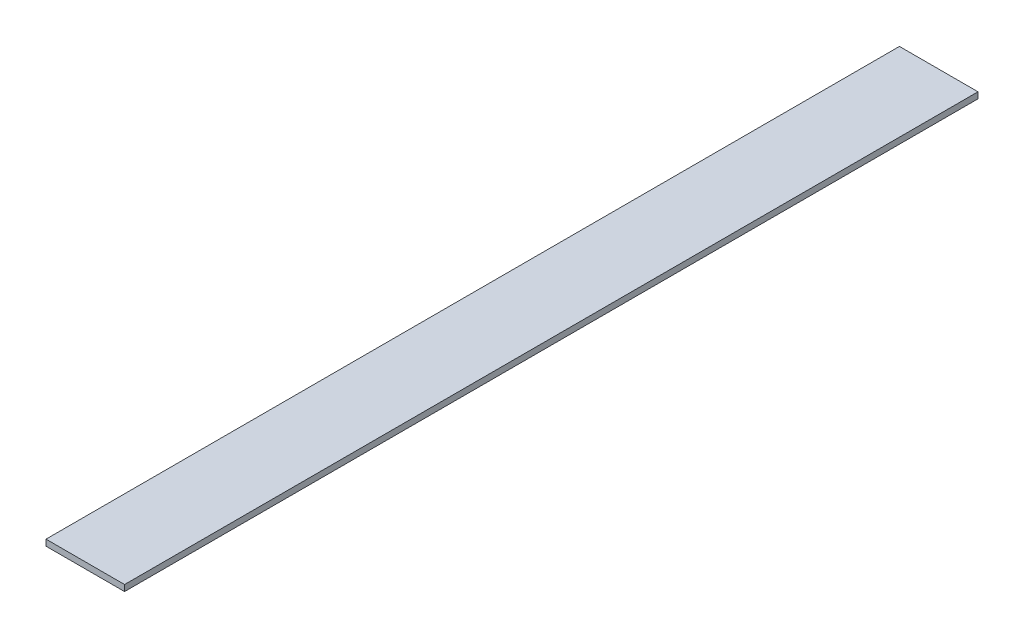
ISO-10303-21;
HEADER;
FILE_DESCRIPTION(('STEP AP214'),'2;1');
FILE_NAME('part.step','',(''),(''),'','','');
FILE_SCHEMA(('AUTOMOTIVE_DESIGN { 1 0 10303 214 1 1 1 1 }'));
ENDSEC;
DATA;
#1=APPLICATION_CONTEXT('core data for automotive mechanical design processes');
#2=APPLICATION_PROTOCOL_DEFINITION('international standard','automotive_design',2000,#1);
#3=PRODUCT_CONTEXT('',#1,'mechanical');
#4=PRODUCT('Part','Part','',(#3));
#5=PRODUCT_RELATED_PRODUCT_CATEGORY('part','',(#4));
#6=PRODUCT_DEFINITION_FORMATION('','',#4);
#7=PRODUCT_DEFINITION_CONTEXT('part definition',#1,'design');
#8=PRODUCT_DEFINITION('design','',#6,#7);
#9=PRODUCT_DEFINITION_SHAPE('','',#8);
#10=(LENGTH_UNIT() NAMED_UNIT(*) SI_UNIT(.MILLI.,.METRE.));
#11=(NAMED_UNIT(*) PLANE_ANGLE_UNIT() SI_UNIT($,.RADIAN.));
#12=(NAMED_UNIT(*) SI_UNIT($,.STERADIAN.) SOLID_ANGLE_UNIT());
#13=UNCERTAINTY_MEASURE_WITH_UNIT(LENGTH_MEASURE(1.E-05),#10,'distance_accuracy_value','');
#14=(GEOMETRIC_REPRESENTATION_CONTEXT(3) GLOBAL_UNCERTAINTY_ASSIGNED_CONTEXT((#13)) GLOBAL_UNIT_ASSIGNED_CONTEXT((#10,
#11,#12)) REPRESENTATION_CONTEXT('',''));
#15=CARTESIAN_POINT('',(0.,0.,0.));
#16=DIRECTION('',(0.,0.,1.));
#17=DIRECTION('',(1.,0.,0.));
#18=AXIS2_PLACEMENT_3D('',#15,#16,#17);
#19=CARTESIAN_POINT('',(0.,0.,441.452));
#20=DIRECTION('',(1.,0.,0.));
#21=DIRECTION('',(0.,0.,-1.));
#22=AXIS2_PLACEMENT_3D('',#19,#20,#21);
#23=PLANE('',#22);
#24=DIRECTION('',(0.,-1.,0.));
#25=VECTOR('',#24,1.);
#26=CARTESIAN_POINT('',(0.,0.,0.));
#27=LINE('',#26,#25);
#28=CARTESIAN_POINT('',(0.,3.175,0.));
#29=VERTEX_POINT('',#28);
#30=CARTESIAN_POINT('',(0.,0.,0.));
#31=VERTEX_POINT('',#30);
#32=EDGE_CURVE('E114',#29,#31,#27,.T.);
#33=ORIENTED_EDGE('',*,*,#32,.T.);
#34=DIRECTION('',(0.,0.,-1.));
#35=VECTOR('',#34,1.);
#36=CARTESIAN_POINT('',(0.,0.,441.452));
#37=LINE('',#36,#35);
#38=CARTESIAN_POINT('',(0.,0.,441.452));
#39=VERTEX_POINT('',#38);
#40=EDGE_CURVE('E11',#39,#31,#37,.T.);
#41=ORIENTED_EDGE('',*,*,#40,.F.);
#42=DIRECTION('',(0.,-1.,0.));
#43=VECTOR('',#42,1.);
#44=CARTESIAN_POINT('',(0.,0.,441.452));
#45=LINE('',#44,#43);
#46=CARTESIAN_POINT('',(0.,3.175,441.452));
#47=VERTEX_POINT('',#46);
#48=EDGE_CURVE('E97',#47,#39,#45,.T.);
#49=ORIENTED_EDGE('',*,*,#48,.F.);
#50=DIRECTION('',(0.,0.,-1.));
#51=VECTOR('',#50,1.);
#52=CARTESIAN_POINT('',(0.,3.175,441.452));
#53=LINE('',#52,#51);
#54=EDGE_CURVE('E110',#47,#29,#53,.T.);
#55=ORIENTED_EDGE('',*,*,#54,.T.);
#56=EDGE_LOOP('',(#33,#41,#49,#55));
#57=FACE_BOUND('',#56,.T.);
#58=ADVANCED_FACE('F45',(#57),#23,.F.);
#59=CARTESIAN_POINT('',(0.,0.,441.452));
#60=DIRECTION('',(0.,1.,0.));
#61=DIRECTION('',(0.,0.,1.));
#62=AXIS2_PLACEMENT_3D('',#59,#60,#61);
#63=PLANE('',#62);
#64=DIRECTION('',(1.,0.,0.));
#65=VECTOR('',#64,1.);
#66=CARTESIAN_POINT('',(0.,0.,0.));
#67=LINE('',#66,#65);
#68=CARTESIAN_POINT('',(40.64,0.,0.));
#69=VERTEX_POINT('',#68);
#70=EDGE_CURVE('E102',#31,#69,#67,.T.);
#71=ORIENTED_EDGE('',*,*,#70,.T.);
#72=DIRECTION('',(0.,0.,-1.));
#73=VECTOR('',#72,1.);
#74=CARTESIAN_POINT('',(40.64,0.,441.452));
#75=LINE('',#74,#73);
#76=CARTESIAN_POINT('',(40.64,0.,441.452));
#77=VERTEX_POINT('',#76);
#78=EDGE_CURVE('E54',#77,#69,#75,.T.);
#79=ORIENTED_EDGE('',*,*,#78,.F.);
#80=DIRECTION('',(1.,0.,0.));
#81=VECTOR('',#80,1.);
#82=CARTESIAN_POINT('',(0.,0.,441.452));
#83=LINE('',#82,#81);
#84=EDGE_CURVE('E92',#39,#77,#83,.T.);
#85=ORIENTED_EDGE('',*,*,#84,.F.);
#86=ORIENTED_EDGE('',*,*,#40,.T.);
#87=EDGE_LOOP('',(#71,#79,#85,#86));
#88=FACE_BOUND('',#87,.T.);
#89=ADVANCED_FACE('F101',(#88),#63,.F.);
#90=CARTESIAN_POINT('',(40.64,0.,441.452));
#91=DIRECTION('',(-1.,0.,0.));
#92=DIRECTION('',(0.,0.,1.));
#93=AXIS2_PLACEMENT_3D('',#90,#91,#92);
#94=PLANE('',#93);
#95=DIRECTION('',(0.,1.,0.));
#96=VECTOR('',#95,1.);
#97=CARTESIAN_POINT('',(40.64,0.,0.));
#98=LINE('',#97,#96);
#99=CARTESIAN_POINT('',(40.64,3.175,0.));
#100=VERTEX_POINT('',#99);
#101=EDGE_CURVE('E79',#69,#100,#98,.T.);
#102=ORIENTED_EDGE('',*,*,#101,.T.);
#103=DIRECTION('',(0.,0.,-1.));
#104=VECTOR('',#103,1.);
#105=CARTESIAN_POINT('',(40.64,3.175,441.452));
#106=LINE('',#105,#104);
#107=CARTESIAN_POINT('',(40.64,3.175,441.452));
#108=VERTEX_POINT('',#107);
#109=EDGE_CURVE('E104',#108,#100,#106,.T.);
#110=ORIENTED_EDGE('',*,*,#109,.F.);
#111=DIRECTION('',(0.,1.,0.));
#112=VECTOR('',#111,1.);
#113=CARTESIAN_POINT('',(40.64,0.,441.452));
#114=LINE('',#113,#112);
#115=EDGE_CURVE('E95',#77,#108,#114,.T.);
#116=ORIENTED_EDGE('',*,*,#115,.F.);
#117=ORIENTED_EDGE('',*,*,#78,.T.);
#118=EDGE_LOOP('',(#102,#110,#116,#117));
#119=FACE_BOUND('',#118,.T.);
#120=ADVANCED_FACE('F105',(#119),#94,.F.);
#121=CARTESIAN_POINT('',(0.,3.175,441.452));
#122=DIRECTION('',(0.,-1.,0.));
#123=DIRECTION('',(1.,0.,0.));
#124=AXIS2_PLACEMENT_3D('',#121,#122,#123);
#125=PLANE('',#124);
#126=DIRECTION('',(-1.,0.,0.));
#127=VECTOR('',#126,1.);
#128=CARTESIAN_POINT('',(0.,3.175,0.));
#129=LINE('',#128,#127);
#130=EDGE_CURVE('E85',#100,#29,#129,.T.);
#131=ORIENTED_EDGE('',*,*,#130,.T.);
#132=ORIENTED_EDGE('',*,*,#54,.F.);
#133=DIRECTION('',(-1.,0.,0.));
#134=VECTOR('',#133,1.);
#135=CARTESIAN_POINT('',(0.,3.175,441.452));
#136=LINE('',#135,#134);
#137=EDGE_CURVE('E62',#108,#47,#136,.T.);
#138=ORIENTED_EDGE('',*,*,#137,.F.);
#139=ORIENTED_EDGE('',*,*,#109,.T.);
#140=EDGE_LOOP('',(#131,#132,#138,#139));
#141=FACE_BOUND('',#140,.T.);
#142=ADVANCED_FACE('F128',(#141),#125,.F.);
#143=CARTESIAN_POINT('',(0.,0.,441.452));
#144=DIRECTION('',(0.,0.,-1.));
#145=DIRECTION('',(-1.,0.,0.));
#146=AXIS2_PLACEMENT_3D('',#143,#144,#145);
#147=PLANE('',#146);
#148=ORIENTED_EDGE('',*,*,#48,.T.);
#149=ORIENTED_EDGE('',*,*,#84,.T.);
#150=ORIENTED_EDGE('',*,*,#115,.T.);
#151=ORIENTED_EDGE('',*,*,#137,.T.);
#152=EDGE_LOOP('',(#148,#149,#150,#151));
#153=FACE_BOUND('',#152,.T.);
#154=ADVANCED_FACE('F93',(#153),#147,.F.);
#155=CARTESIAN_POINT('',(0.,0.,0.));
#156=DIRECTION('',(0.,0.,-1.));
#157=DIRECTION('',(-1.,0.,0.));
#158=AXIS2_PLACEMENT_3D('',#155,#156,#157);
#159=PLANE('',#158);
#160=ORIENTED_EDGE('',*,*,#32,.F.);
#161=ORIENTED_EDGE('',*,*,#130,.F.);
#162=ORIENTED_EDGE('',*,*,#101,.F.);
#163=ORIENTED_EDGE('',*,*,#70,.F.);
#164=EDGE_LOOP('',(#160,#161,#162,#163));
#165=FACE_BOUND('',#164,.T.);
#166=ADVANCED_FACE('F131',(#165),#159,.T.);
#167=CLOSED_SHELL('',(#58,#89,#120,#142,#154,#166));
#168=MANIFOLD_SOLID_BREP('B2',#167);
#169=ADVANCED_BREP_SHAPE_REPRESENTATION('',(#18,#168),#14);
#170=SHAPE_DEFINITION_REPRESENTATION(#9,#169);
ENDSEC;
END-ISO-10303-21;
